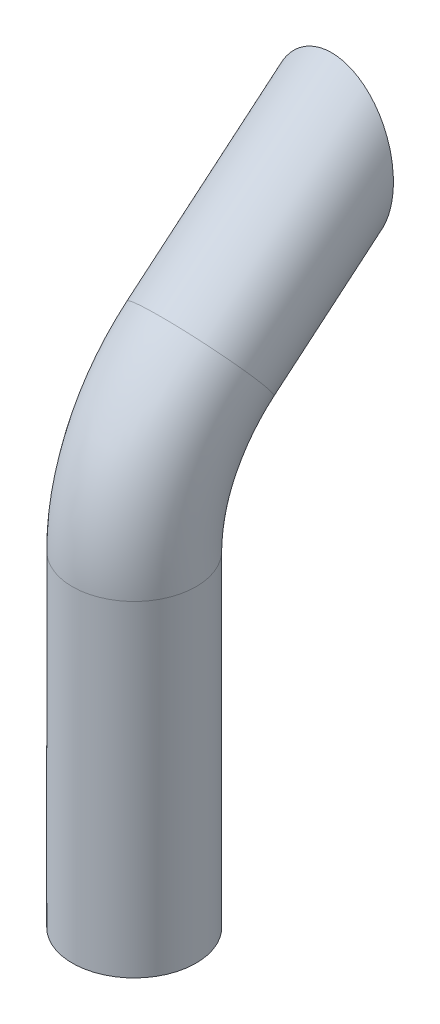
ISO-10303-21;
HEADER;
FILE_DESCRIPTION(('STEP AP214'),'2;1');
FILE_NAME('part.step','',(''),(''),'','','');
FILE_SCHEMA(('AUTOMOTIVE_DESIGN { 1 0 10303 214 1 1 1 1 }'));
ENDSEC;
DATA;
#1=APPLICATION_CONTEXT('core data for automotive mechanical design processes');
#2=APPLICATION_PROTOCOL_DEFINITION('international standard','automotive_design',2000,#1);
#3=PRODUCT_CONTEXT('',#1,'mechanical');
#4=PRODUCT('Part','Part','',(#3));
#5=PRODUCT_RELATED_PRODUCT_CATEGORY('part','',(#4));
#6=PRODUCT_DEFINITION_FORMATION('','',#4);
#7=PRODUCT_DEFINITION_CONTEXT('part definition',#1,'design');
#8=PRODUCT_DEFINITION('design','',#6,#7);
#9=PRODUCT_DEFINITION_SHAPE('','',#8);
#10=(LENGTH_UNIT() NAMED_UNIT(*) SI_UNIT(.MILLI.,.METRE.));
#11=(NAMED_UNIT(*) PLANE_ANGLE_UNIT() SI_UNIT($,.RADIAN.));
#12=(NAMED_UNIT(*) SI_UNIT($,.STERADIAN.) SOLID_ANGLE_UNIT());
#13=UNCERTAINTY_MEASURE_WITH_UNIT(LENGTH_MEASURE(1.E-05),#10,'distance_accuracy_value','');
#14=(GEOMETRIC_REPRESENTATION_CONTEXT(3) GLOBAL_UNCERTAINTY_ASSIGNED_CONTEXT((#13)) GLOBAL_UNIT_ASSIGNED_CONTEXT((#10,
#11,#12)) REPRESENTATION_CONTEXT('',''));
#15=CARTESIAN_POINT('',(0.,0.,0.));
#16=DIRECTION('',(0.,0.,1.));
#17=DIRECTION('',(1.,0.,0.));
#18=AXIS2_PLACEMENT_3D('',#15,#16,#17);
#19=CARTESIAN_POINT('',(0.,-296.418141452981,114.906666467847));
#20=DIRECTION('',(0.,-1.,0.));
#21=DIRECTION('',(0.,0.,-1.));
#22=AXIS2_PLACEMENT_3D('',#19,#20,#21);
#23=PLANE('',#22);
#24=CARTESIAN_POINT('',(0.,-296.418141452981,114.906666467847));
#25=DIRECTION('',(0.,-1.,0.));
#26=DIRECTION('',(0.,0.,-1.));
#27=AXIS2_PLACEMENT_3D('',#24,#25,#26);
#28=CIRCLE('',#27,27.);
#29=CARTESIAN_POINT('',(0.,-296.418141452981,87.9066664678468));
#30=VERTEX_POINT('',#29);
#31=EDGE_CURVE('E47',#30,#30,#28,.T.);
#32=ORIENTED_EDGE('',*,*,#31,.F.);
#33=EDGE_LOOP('',(#32));
#34=FACE_BOUND('',#33,.T.);
#35=CARTESIAN_POINT('',(0.,-296.418141452981,114.906666467847));
#36=DIRECTION('',(0.,-1.,0.));
#37=DIRECTION('',(0.,0.,-1.));
#38=AXIS2_PLACEMENT_3D('',#35,#36,#37);
#39=CIRCLE('',#38,30.);
#40=CARTESIAN_POINT('',(0.,-296.418141452981,84.9066664678468));
#41=VERTEX_POINT('',#40);
#42=EDGE_CURVE('E10',#41,#41,#39,.T.);
#43=ORIENTED_EDGE('',*,*,#42,.T.);
#44=EDGE_LOOP('',(#43));
#45=FACE_BOUND('',#44,.T.);
#46=ADVANCED_FACE('F31',(#34,#45),#23,.T.);
#47=CARTESIAN_POINT('',(0.,0.,0.));
#48=DIRECTION('',(0.,-0.642787609686538,0.766044443118979));
#49=DIRECTION('',(0.,-0.766044443118979,-0.642787609686538));
#50=AXIS2_PLACEMENT_3D('',#47,#48,#49);
#51=CYLINDRICAL_SURFACE('',#50,30.);
#52=CARTESIAN_POINT('',(0.,-16.1808853863989,19.2836282905961));
#53=DIRECTION('',(0.,0.,1.));
#54=DIRECTION('',(0.,-1.,0.));
#55=AXIS2_PLACEMENT_3D('',#52,#53,#54);
#56=ELLIPSE('',#55,39.1622186799683,30.);
#57=CARTESIAN_POINT('',(0.,-55.3431040663672,19.2836282905961));
#58=VERTEX_POINT('',#57);
#59=EDGE_CURVE('E56',#58,#58,#56,.F.);
#60=ORIENTED_EDGE('',*,*,#59,.F.);
#61=EDGE_LOOP('',(#60));
#62=FACE_BOUND('',#61,.T.);
#63=CARTESIAN_POINT('',(0.,-69.4418308062222,82.757551339635));
#64=DIRECTION('',(0.,-0.642787609686538,0.766044443118979));
#65=DIRECTION('',(0.,-0.766044443118979,-0.642787609686538));
#66=AXIS2_PLACEMENT_3D('',#63,#64,#65);
#67=CIRCLE('',#66,30.);
#68=CARTESIAN_POINT('',(0.,-46.4604975126528,102.041179630231));
#69=VERTEX_POINT('',#68);
#70=EDGE_CURVE('E42',#69,#69,#67,.T.);
#71=ORIENTED_EDGE('',*,*,#70,.F.);
#72=EDGE_LOOP('',(#71));
#73=FACE_BOUND('',#72,.T.);
#74=ADVANCED_FACE('F85',(#62,#73),#51,.T.);
#75=CARTESIAN_POINT('',(0.,-138.385830686931,24.9066664678469));
#76=DIRECTION('',(1.,0.,0.));
#77=DIRECTION('',(0.,0.,-1.));
#78=AXIS2_PLACEMENT_3D('',#75,#76,#77);
#79=TOROIDAL_SURFACE('',#78,90.,30.);
#80=CARTESIAN_POINT('',(0.,-138.385830686931,114.906666467847));
#81=DIRECTION('',(0.,-1.,0.));
#82=DIRECTION('',(0.,0.,-1.));
#83=AXIS2_PLACEMENT_3D('',#80,#81,#82);
#84=CIRCLE('',#83,30.);
#85=CARTESIAN_POINT('',(0.,-138.385830686931,144.906666467847));
#86=VERTEX_POINT('',#85);
#87=EDGE_CURVE('E38',#86,#86,#84,.T.);
#88=CARTESIAN_POINT('',(0.,-138.385830686931,24.9066664678469));
#89=DIRECTION('',(1.,0.,0.));
#90=DIRECTION('',(0.,0.,-1.));
#91=AXIS2_PLACEMENT_3D('',#88,#89,#90);
#92=CIRCLE('',#91,120.);
#93=EDGE_CURVE('',#69,#86,#92,.T.);
#94=ORIENTED_EDGE('',*,*,#70,.T.);
#95=ORIENTED_EDGE('',*,*,#87,.F.);
#96=ORIENTED_EDGE('',*,*,#93,.T.);
#97=ORIENTED_EDGE('',*,*,#93,.F.);
#98=EDGE_LOOP('',(#94,#96,#95,#97));
#99=FACE_BOUND('',#98,.T.);
#100=ADVANCED_FACE('F80',(#99),#79,.T.);
#101=CARTESIAN_POINT('',(0.,-138.385830686931,114.906666467847));
#102=DIRECTION('',(0.,-1.,0.));
#103=DIRECTION('',(0.,0.,-1.));
#104=AXIS2_PLACEMENT_3D('',#101,#102,#103);
#105=CYLINDRICAL_SURFACE('',#104,30.);
#106=ORIENTED_EDGE('',*,*,#42,.F.);
#107=EDGE_LOOP('',(#106));
#108=FACE_BOUND('',#107,.T.);
#109=ORIENTED_EDGE('',*,*,#87,.T.);
#110=EDGE_LOOP('',(#109));
#111=FACE_BOUND('',#110,.T.);
#112=ADVANCED_FACE('F78',(#108,#111),#105,.T.);
#113=CARTESIAN_POINT('',(0.,0.,0.));
#114=DIRECTION('',(0.,-0.642787609686538,0.766044443118979));
#115=DIRECTION('',(0.,-0.766044443118979,-0.642787609686538));
#116=AXIS2_PLACEMENT_3D('',#113,#114,#115);
#117=CYLINDRICAL_SURFACE('',#116,27.);
#118=CARTESIAN_POINT('',(0.,-16.1808853863989,19.2836282905961));
#119=DIRECTION('',(0.,0.,1.));
#120=DIRECTION('',(0.,-1.,0.));
#121=AXIS2_PLACEMENT_3D('',#118,#119,#120);
#122=ELLIPSE('',#121,35.2459968119715,27.);
#123=CARTESIAN_POINT('',(0.,-51.4268821983704,19.2836282905961));
#124=VERTEX_POINT('',#123);
#125=EDGE_CURVE('E34',#124,#124,#122,.F.);
#126=ORIENTED_EDGE('',*,*,#125,.T.);
#127=EDGE_LOOP('',(#126));
#128=FACE_BOUND('',#127,.T.);
#129=CARTESIAN_POINT('',(0.,-69.4418308062223,82.757551339635));
#130=DIRECTION('',(0.,0.642787609686535,-0.766044443118981));
#131=DIRECTION('',(0.,0.766044443118981,0.642787609686535));
#132=AXIS2_PLACEMENT_3D('',#129,#130,#131);
#133=CIRCLE('',#132,27.);
#134=CARTESIAN_POINT('',(0.,-48.7586308420098,100.112816801171));
#135=VERTEX_POINT('',#134);
#136=EDGE_CURVE('E53',#135,#135,#133,.F.);
#137=ORIENTED_EDGE('',*,*,#136,.T.);
#138=EDGE_LOOP('',(#137));
#139=FACE_BOUND('',#138,.T.);
#140=ADVANCED_FACE('F63',(#128,#139),#117,.F.);
#141=CARTESIAN_POINT('',(0.,-138.385830686931,24.9066664678469));
#142=DIRECTION('',(1.,0.,0.));
#143=DIRECTION('',(0.,0.,-1.));
#144=AXIS2_PLACEMENT_3D('',#141,#142,#143);
#145=TOROIDAL_SURFACE('',#144,90.,27.);
#146=CARTESIAN_POINT('',(0.,-138.385830686931,114.906666467847));
#147=DIRECTION('',(0.,-1.,0.));
#148=DIRECTION('',(0.,0.,-1.));
#149=AXIS2_PLACEMENT_3D('',#146,#147,#148);
#150=CIRCLE('',#149,27.);
#151=CARTESIAN_POINT('',(0.,-138.385830686931,141.906666467847));
#152=VERTEX_POINT('',#151);
#153=EDGE_CURVE('E50',#152,#152,#150,.T.);
#154=CARTESIAN_POINT('',(0.,-138.385830686931,24.9066664678469));
#155=DIRECTION('',(1.,0.,0.));
#156=DIRECTION('',(0.,0.,-1.));
#157=AXIS2_PLACEMENT_3D('',#154,#155,#156);
#158=CIRCLE('',#157,117.);
#159=EDGE_CURVE('',#135,#152,#158,.T.);
#160=ORIENTED_EDGE('',*,*,#136,.F.);
#161=ORIENTED_EDGE('',*,*,#153,.T.);
#162=ORIENTED_EDGE('',*,*,#159,.T.);
#163=ORIENTED_EDGE('',*,*,#159,.F.);
#164=EDGE_LOOP('',(#160,#162,#161,#163));
#165=FACE_BOUND('',#164,.T.);
#166=ADVANCED_FACE('F73',(#165),#145,.F.);
#167=CARTESIAN_POINT('',(0.,-138.385830686931,114.906666467847));
#168=DIRECTION('',(0.,-1.,0.));
#169=DIRECTION('',(0.,0.,-1.));
#170=AXIS2_PLACEMENT_3D('',#167,#168,#169);
#171=CYLINDRICAL_SURFACE('',#170,27.);
#172=ORIENTED_EDGE('',*,*,#31,.T.);
#173=EDGE_LOOP('',(#172));
#174=FACE_BOUND('',#173,.T.);
#175=ORIENTED_EDGE('',*,*,#153,.F.);
#176=EDGE_LOOP('',(#175));
#177=FACE_BOUND('',#176,.T.);
#178=ADVANCED_FACE('F68',(#174,#177),#171,.F.);
#179=CARTESIAN_POINT('',(-65.,22.9813332935694,19.2836282905961));
#180=DIRECTION('',(0.,0.,1.));
#181=DIRECTION('',(1.,0.,0.));
#182=AXIS2_PLACEMENT_3D('',#179,#180,#181);
#183=PLANE('',#182);
#184=ORIENTED_EDGE('',*,*,#59,.T.);
#185=EDGE_LOOP('',(#184));
#186=FACE_BOUND('',#185,.T.);
#187=ORIENTED_EDGE('',*,*,#125,.F.);
#188=EDGE_LOOP('',(#187));
#189=FACE_BOUND('',#188,.T.);
#190=ADVANCED_FACE('F66',(#186,#189),#183,.F.);
#191=CLOSED_SHELL('',(#46,#74,#100,#112,#140,#166,#178,#190));
#192=MANIFOLD_SOLID_BREP('B2',#191);
#193=ADVANCED_BREP_SHAPE_REPRESENTATION('',(#18,#192),#14);
#194=SHAPE_DEFINITION_REPRESENTATION(#9,#193);
ENDSEC;
END-ISO-10303-21;
